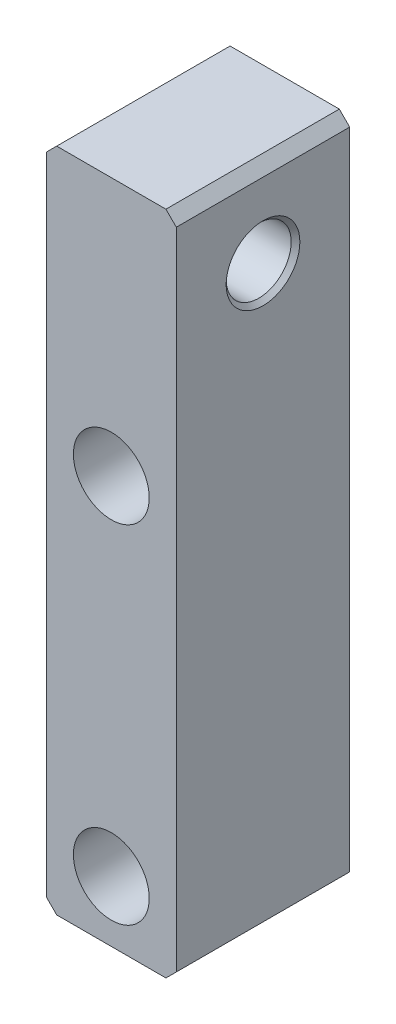
ISO-10303-21;
HEADER;
FILE_DESCRIPTION(('STEP AP214'),'2;1');
FILE_NAME('part.step','',(''),(''),'','','');
FILE_SCHEMA(('AUTOMOTIVE_DESIGN { 1 0 10303 214 1 1 1 1 }'));
ENDSEC;
DATA;
#1=APPLICATION_CONTEXT('core data for automotive mechanical design processes');
#2=APPLICATION_PROTOCOL_DEFINITION('international standard','automotive_design',2000,#1);
#3=PRODUCT_CONTEXT('',#1,'mechanical');
#4=PRODUCT('Part','Part','',(#3));
#5=PRODUCT_RELATED_PRODUCT_CATEGORY('part','',(#4));
#6=PRODUCT_DEFINITION_FORMATION('','',#4);
#7=PRODUCT_DEFINITION_CONTEXT('part definition',#1,'design');
#8=PRODUCT_DEFINITION('design','',#6,#7);
#9=PRODUCT_DEFINITION_SHAPE('','',#8);
#10=(LENGTH_UNIT() NAMED_UNIT(*) SI_UNIT(.MILLI.,.METRE.));
#11=(NAMED_UNIT(*) PLANE_ANGLE_UNIT() SI_UNIT($,.RADIAN.));
#12=(NAMED_UNIT(*) SI_UNIT($,.STERADIAN.) SOLID_ANGLE_UNIT());
#13=UNCERTAINTY_MEASURE_WITH_UNIT(LENGTH_MEASURE(1.E-05),#10,'distance_accuracy_value','');
#14=(GEOMETRIC_REPRESENTATION_CONTEXT(3) GLOBAL_UNCERTAINTY_ASSIGNED_CONTEXT((#13)) GLOBAL_UNIT_ASSIGNED_CONTEXT((#10,
#11,#12)) REPRESENTATION_CONTEXT('',''));
#15=CARTESIAN_POINT('',(0.,0.,0.));
#16=DIRECTION('',(0.,0.,1.));
#17=DIRECTION('',(1.,0.,0.));
#18=AXIS2_PLACEMENT_3D('',#15,#16,#17);
#19=CARTESIAN_POINT('',(-9.52500000000001,87.122,-12.7));
#20=DIRECTION('',(-0.707106781186549,0.707106781186546,0.));
#21=DIRECTION('',(-0.707106781186546,-0.707106781186549,0.));
#22=AXIS2_PLACEMENT_3D('',#19,#20,#21);
#23=PLANE('',#22);
#24=DIRECTION('',(-0.707106781186546,-0.707106781186549,0.));
#25=VECTOR('',#24,1.);
#26=CARTESIAN_POINT('',(-9.52500000000001,87.122,12.7));
#27=LINE('',#26,#25);
#28=CARTESIAN_POINT('',(-8.00100000000002,88.646,12.7));
#29=VERTEX_POINT('',#28);
#30=CARTESIAN_POINT('',(-9.52500000000001,87.122,12.7));
#31=VERTEX_POINT('',#30);
#32=EDGE_CURVE('E136',#29,#31,#27,.T.);
#33=ORIENTED_EDGE('',*,*,#32,.F.);
#34=DIRECTION('',(0.,0.,1.));
#35=VECTOR('',#34,1.);
#36=CARTESIAN_POINT('',(-8.00100000000002,88.646,-12.7));
#37=LINE('',#36,#35);
#38=CARTESIAN_POINT('',(-8.00100000000002,88.646,-12.7));
#39=VERTEX_POINT('',#38);
#40=EDGE_CURVE('E11',#39,#29,#37,.T.);
#41=ORIENTED_EDGE('',*,*,#40,.F.);
#42=DIRECTION('',(-0.707106781186546,-0.707106781186549,0.));
#43=VECTOR('',#42,1.);
#44=CARTESIAN_POINT('',(-9.52500000000001,87.122,-12.7));
#45=LINE('',#44,#43);
#46=CARTESIAN_POINT('',(-9.52500000000001,87.122,-12.7));
#47=VERTEX_POINT('',#46);
#48=EDGE_CURVE('E157',#39,#47,#45,.T.);
#49=ORIENTED_EDGE('',*,*,#48,.T.);
#50=DIRECTION('',(0.,0.,1.));
#51=VECTOR('',#50,1.);
#52=CARTESIAN_POINT('',(-9.52500000000001,87.122,-12.7));
#53=LINE('',#52,#51);
#54=EDGE_CURVE('E42',#47,#31,#53,.T.);
#55=ORIENTED_EDGE('',*,*,#54,.T.);
#56=EDGE_LOOP('',(#33,#41,#49,#55));
#57=FACE_BOUND('',#56,.T.);
#58=ADVANCED_FACE('F39',(#57),#23,.T.);
#59=CARTESIAN_POINT('',(-8.00100000000002,88.646,-12.7));
#60=DIRECTION('',(0.,1.,0.));
#61=DIRECTION('',(0.,0.,1.));
#62=AXIS2_PLACEMENT_3D('',#59,#60,#61);
#63=PLANE('',#62);
#64=DIRECTION('',(-1.,0.,0.));
#65=VECTOR('',#64,1.);
#66=CARTESIAN_POINT('',(-8.00100000000002,88.646,12.7));
#67=LINE('',#66,#65);
#68=CARTESIAN_POINT('',(8.001,88.646,12.7));
#69=VERTEX_POINT('',#68);
#70=EDGE_CURVE('E155',#69,#29,#67,.T.);
#71=ORIENTED_EDGE('',*,*,#70,.F.);
#72=DIRECTION('',(0.,0.,1.));
#73=VECTOR('',#72,1.);
#74=CARTESIAN_POINT('',(8.001,88.646,-12.7));
#75=LINE('',#74,#73);
#76=CARTESIAN_POINT('',(8.001,88.646,-12.7));
#77=VERTEX_POINT('',#76);
#78=EDGE_CURVE('E48',#77,#69,#75,.T.);
#79=ORIENTED_EDGE('',*,*,#78,.F.);
#80=DIRECTION('',(-1.,0.,0.));
#81=VECTOR('',#80,1.);
#82=CARTESIAN_POINT('',(-8.00100000000002,88.646,-12.7));
#83=LINE('',#82,#81);
#84=EDGE_CURVE('E126',#77,#39,#83,.T.);
#85=ORIENTED_EDGE('',*,*,#84,.T.);
#86=ORIENTED_EDGE('',*,*,#40,.T.);
#87=EDGE_LOOP('',(#71,#79,#85,#86));
#88=FACE_BOUND('',#87,.T.);
#89=ADVANCED_FACE('F169',(#88),#63,.T.);
#90=CARTESIAN_POINT('',(8.001,88.646,-12.7));
#91=DIRECTION('',(0.707106781186545,0.70710678118655,0.));
#92=DIRECTION('',(-0.70710678118655,0.707106781186545,0.));
#93=AXIS2_PLACEMENT_3D('',#90,#91,#92);
#94=PLANE('',#93);
#95=DIRECTION('',(-0.70710678118655,0.707106781186545,0.));
#96=VECTOR('',#95,1.);
#97=CARTESIAN_POINT('',(8.001,88.646,12.7));
#98=LINE('',#97,#96);
#99=CARTESIAN_POINT('',(9.52499999999999,87.122,12.7));
#100=VERTEX_POINT('',#99);
#101=EDGE_CURVE('E113',#100,#69,#98,.T.);
#102=ORIENTED_EDGE('',*,*,#101,.F.);
#103=DIRECTION('',(0.,0.,1.));
#104=VECTOR('',#103,1.);
#105=CARTESIAN_POINT('',(9.52499999999999,87.122,-12.7));
#106=LINE('',#105,#104);
#107=CARTESIAN_POINT('',(9.52499999999999,87.122,-12.7));
#108=VERTEX_POINT('',#107);
#109=EDGE_CURVE('E108',#108,#100,#106,.T.);
#110=ORIENTED_EDGE('',*,*,#109,.F.);
#111=DIRECTION('',(-0.70710678118655,0.707106781186545,0.));
#112=VECTOR('',#111,1.);
#113=CARTESIAN_POINT('',(8.001,88.646,-12.7));
#114=LINE('',#113,#112);
#115=EDGE_CURVE('E111',#108,#77,#114,.T.);
#116=ORIENTED_EDGE('',*,*,#115,.T.);
#117=ORIENTED_EDGE('',*,*,#78,.T.);
#118=EDGE_LOOP('',(#102,#110,#116,#117));
#119=FACE_BOUND('',#118,.T.);
#120=ADVANCED_FACE('F110',(#119),#94,.T.);
#121=CARTESIAN_POINT('',(9.52499999999999,87.122,-12.7));
#122=DIRECTION('',(1.,0.,0.));
#123=DIRECTION('',(0.,1.,0.));
#124=AXIS2_PLACEMENT_3D('',#121,#122,#123);
#125=PLANE('',#124);
#126=CARTESIAN_POINT('',(9.52500000000001,76.2,0.));
#127=DIRECTION('',(1.,0.,0.));
#128=DIRECTION('',(0.,0.,-1.));
#129=AXIS2_PLACEMENT_3D('',#126,#127,#128);
#130=CIRCLE('',#129,5.3975);
#131=CARTESIAN_POINT('',(9.52500000000001,76.2,-5.3975));
#132=VERTEX_POINT('',#131);
#133=EDGE_CURVE('E204',#132,#132,#130,.T.);
#134=ORIENTED_EDGE('',*,*,#133,.F.);
#135=EDGE_LOOP('',(#134));
#136=FACE_BOUND('',#135,.T.);
#137=DIRECTION('',(0.,1.,0.));
#138=VECTOR('',#137,1.);
#139=CARTESIAN_POINT('',(9.52499999999999,87.122,12.7));
#140=LINE('',#139,#138);
#141=CARTESIAN_POINT('',(9.52500000000003,-7.36599999999991,12.7));
#142=VERTEX_POINT('',#141);
#143=EDGE_CURVE('E152',#142,#100,#140,.T.);
#144=ORIENTED_EDGE('',*,*,#143,.F.);
#145=DIRECTION('',(0.,0.,1.));
#146=VECTOR('',#145,1.);
#147=CARTESIAN_POINT('',(9.52500000000003,-7.36599999999991,-12.7));
#148=LINE('',#147,#146);
#149=CARTESIAN_POINT('',(9.52500000000003,-7.36599999999991,-12.7));
#150=VERTEX_POINT('',#149);
#151=EDGE_CURVE('E118',#150,#142,#148,.T.);
#152=ORIENTED_EDGE('',*,*,#151,.F.);
#153=DIRECTION('',(0.,1.,0.));
#154=VECTOR('',#153,1.);
#155=CARTESIAN_POINT('',(9.52499999999999,87.122,-12.7));
#156=LINE('',#155,#154);
#157=EDGE_CURVE('E124',#150,#108,#156,.T.);
#158=ORIENTED_EDGE('',*,*,#157,.T.);
#159=ORIENTED_EDGE('',*,*,#109,.T.);
#160=EDGE_LOOP('',(#144,#152,#158,#159));
#161=FACE_BOUND('',#160,.T.);
#162=ADVANCED_FACE('F128',(#136,#161),#125,.T.);
#163=CARTESIAN_POINT('',(8.00100000000004,-8.88999999999991,-12.7));
#164=DIRECTION('',(0.70710678118655,-0.707106781186545,0.));
#165=DIRECTION('',(0.707106781186545,0.70710678118655,0.));
#166=AXIS2_PLACEMENT_3D('',#163,#164,#165);
#167=PLANE('',#166);
#168=DIRECTION('',(0.707106781186545,0.70710678118655,0.));
#169=VECTOR('',#168,1.);
#170=CARTESIAN_POINT('',(8.00100000000004,-8.88999999999991,12.7));
#171=LINE('',#170,#169);
#172=CARTESIAN_POINT('',(8.00100000000004,-8.88999999999991,12.7));
#173=VERTEX_POINT('',#172);
#174=EDGE_CURVE('E149',#173,#142,#171,.T.);
#175=ORIENTED_EDGE('',*,*,#174,.F.);
#176=DIRECTION('',(0.,0.,1.));
#177=VECTOR('',#176,1.);
#178=CARTESIAN_POINT('',(8.00100000000004,-8.88999999999991,-12.7));
#179=LINE('',#178,#177);
#180=CARTESIAN_POINT('',(8.00100000000004,-8.88999999999991,-12.7));
#181=VERTEX_POINT('',#180);
#182=EDGE_CURVE('E161',#181,#173,#179,.T.);
#183=ORIENTED_EDGE('',*,*,#182,.F.);
#184=DIRECTION('',(0.707106781186545,0.70710678118655,0.));
#185=VECTOR('',#184,1.);
#186=CARTESIAN_POINT('',(8.00100000000004,-8.88999999999991,-12.7));
#187=LINE('',#186,#185);
#188=EDGE_CURVE('E129',#181,#150,#187,.T.);
#189=ORIENTED_EDGE('',*,*,#188,.T.);
#190=ORIENTED_EDGE('',*,*,#151,.T.);
#191=EDGE_LOOP('',(#175,#183,#189,#190));
#192=FACE_BOUND('',#191,.T.);
#193=ADVANCED_FACE('F182',(#192),#167,.T.);
#194=CARTESIAN_POINT('',(-8.00099999999999,-8.88999999999992,-12.7));
#195=DIRECTION('',(0.,-1.,0.));
#196=DIRECTION('',(1.,0.,0.));
#197=AXIS2_PLACEMENT_3D('',#194,#195,#196);
#198=PLANE('',#197);
#199=DIRECTION('',(1.,0.,0.));
#200=VECTOR('',#199,1.);
#201=CARTESIAN_POINT('',(-8.00099999999999,-8.88999999999992,12.7));
#202=LINE('',#201,#200);
#203=CARTESIAN_POINT('',(-8.00099999999999,-8.88999999999992,12.7));
#204=VERTEX_POINT('',#203);
#205=EDGE_CURVE('E146',#204,#173,#202,.T.);
#206=ORIENTED_EDGE('',*,*,#205,.F.);
#207=DIRECTION('',(0.,0.,1.));
#208=VECTOR('',#207,1.);
#209=CARTESIAN_POINT('',(-8.00099999999999,-8.88999999999992,-12.7));
#210=LINE('',#209,#208);
#211=CARTESIAN_POINT('',(-8.00099999999999,-8.88999999999992,-12.7));
#212=VERTEX_POINT('',#211);
#213=EDGE_CURVE('E163',#212,#204,#210,.T.);
#214=ORIENTED_EDGE('',*,*,#213,.F.);
#215=DIRECTION('',(1.,0.,0.));
#216=VECTOR('',#215,1.);
#217=CARTESIAN_POINT('',(-8.00099999999999,-8.88999999999992,-12.7));
#218=LINE('',#217,#216);
#219=EDGE_CURVE('E131',#212,#181,#218,.T.);
#220=ORIENTED_EDGE('',*,*,#219,.T.);
#221=ORIENTED_EDGE('',*,*,#182,.T.);
#222=EDGE_LOOP('',(#206,#214,#220,#221));
#223=FACE_BOUND('',#222,.T.);
#224=ADVANCED_FACE('F186',(#223),#198,.T.);
#225=CARTESIAN_POINT('',(-9.52499999999998,-7.36599999999993,-12.7));
#226=DIRECTION('',(-0.707106781186547,-0.707106781186548,0.));
#227=DIRECTION('',(0.707106781186548,-0.707106781186547,0.));
#228=AXIS2_PLACEMENT_3D('',#225,#226,#227);
#229=PLANE('',#228);
#230=DIRECTION('',(0.707106781186548,-0.707106781186547,0.));
#231=VECTOR('',#230,1.);
#232=CARTESIAN_POINT('',(-9.52499999999998,-7.36599999999993,12.7));
#233=LINE('',#232,#231);
#234=CARTESIAN_POINT('',(-9.52499999999998,-7.36599999999993,12.7));
#235=VERTEX_POINT('',#234);
#236=EDGE_CURVE('E143',#235,#204,#233,.T.);
#237=ORIENTED_EDGE('',*,*,#236,.F.);
#238=DIRECTION('',(0.,0.,1.));
#239=VECTOR('',#238,1.);
#240=CARTESIAN_POINT('',(-9.52499999999998,-7.36599999999993,-12.7));
#241=LINE('',#240,#239);
#242=CARTESIAN_POINT('',(-9.52499999999998,-7.36599999999993,-12.7));
#243=VERTEX_POINT('',#242);
#244=EDGE_CURVE('E164',#243,#235,#241,.T.);
#245=ORIENTED_EDGE('',*,*,#244,.F.);
#246=DIRECTION('',(0.707106781186548,-0.707106781186547,0.));
#247=VECTOR('',#246,1.);
#248=CARTESIAN_POINT('',(-9.52499999999998,-7.36599999999993,-12.7));
#249=LINE('',#248,#247);
#250=EDGE_CURVE('E222',#243,#212,#249,.T.);
#251=ORIENTED_EDGE('',*,*,#250,.T.);
#252=ORIENTED_EDGE('',*,*,#213,.T.);
#253=EDGE_LOOP('',(#237,#245,#251,#252));
#254=FACE_BOUND('',#253,.T.);
#255=ADVANCED_FACE('F190',(#254),#229,.T.);
#256=CARTESIAN_POINT('',(-9.52500000000001,87.122,-12.7));
#257=DIRECTION('',(-1.,0.,0.));
#258=DIRECTION('',(0.,-1.,0.));
#259=AXIS2_PLACEMENT_3D('',#256,#257,#258);
#260=PLANE('',#259);
#261=CARTESIAN_POINT('',(-9.525,76.2,0.));
#262=DIRECTION('',(1.,0.,0.));
#263=DIRECTION('',(0.,0.,-1.));
#264=AXIS2_PLACEMENT_3D('',#261,#262,#263);
#265=CIRCLE('',#264,5.3975);
#266=CARTESIAN_POINT('',(-9.525,76.2,-5.3975));
#267=VERTEX_POINT('',#266);
#268=EDGE_CURVE('E202',#267,#267,#265,.T.);
#269=ORIENTED_EDGE('',*,*,#268,.T.);
#270=EDGE_LOOP('',(#269));
#271=FACE_BOUND('',#270,.T.);
#272=DIRECTION('',(0.,-1.,0.));
#273=VECTOR('',#272,1.);
#274=CARTESIAN_POINT('',(-9.52500000000001,87.122,12.7));
#275=LINE('',#274,#273);
#276=EDGE_CURVE('E139',#31,#235,#275,.T.);
#277=ORIENTED_EDGE('',*,*,#276,.F.);
#278=ORIENTED_EDGE('',*,*,#54,.F.);
#279=DIRECTION('',(0.,-1.,0.));
#280=VECTOR('',#279,1.);
#281=CARTESIAN_POINT('',(-9.52500000000001,87.122,-12.7));
#282=LINE('',#281,#280);
#283=EDGE_CURVE('E220',#47,#243,#282,.T.);
#284=ORIENTED_EDGE('',*,*,#283,.T.);
#285=ORIENTED_EDGE('',*,*,#244,.T.);
#286=EDGE_LOOP('',(#277,#278,#284,#285));
#287=FACE_BOUND('',#286,.T.);
#288=ADVANCED_FACE('F166',(#271,#287),#260,.T.);
#289=CARTESIAN_POINT('',(0.,0.,-12.7));
#290=DIRECTION('',(0.,0.,-1.));
#291=DIRECTION('',(-1.,0.,0.));
#292=AXIS2_PLACEMENT_3D('',#289,#290,#291);
#293=PLANE('',#292);
#294=CARTESIAN_POINT('',(0.,0.,-12.7));
#295=DIRECTION('',(0.,0.,-1.));
#296=DIRECTION('',(-1.,0.,0.));
#297=AXIS2_PLACEMENT_3D('',#294,#295,#296);
#298=CIRCLE('',#297,3.3782);
#299=CARTESIAN_POINT('',(-3.3782,0.,-12.7));
#300=VERTEX_POINT('',#299);
#301=EDGE_CURVE('E269',#300,#300,#298,.T.);
#302=ORIENTED_EDGE('',*,*,#301,.F.);
#303=EDGE_LOOP('',(#302));
#304=FACE_BOUND('',#303,.T.);
#305=CARTESIAN_POINT('',(0.,50.8,-12.7));
#306=DIRECTION('',(0.,0.,-1.));
#307=DIRECTION('',(-1.,0.,0.));
#308=AXIS2_PLACEMENT_3D('',#305,#306,#307);
#309=CIRCLE('',#308,3.3782);
#310=CARTESIAN_POINT('',(-3.3782,50.8,-12.7));
#311=VERTEX_POINT('',#310);
#312=EDGE_CURVE('E205',#311,#311,#309,.T.);
#313=ORIENTED_EDGE('',*,*,#312,.F.);
#314=EDGE_LOOP('',(#313));
#315=FACE_BOUND('',#314,.T.);
#316=ORIENTED_EDGE('',*,*,#48,.F.);
#317=ORIENTED_EDGE('',*,*,#84,.F.);
#318=ORIENTED_EDGE('',*,*,#115,.F.);
#319=ORIENTED_EDGE('',*,*,#157,.F.);
#320=ORIENTED_EDGE('',*,*,#188,.F.);
#321=ORIENTED_EDGE('',*,*,#219,.F.);
#322=ORIENTED_EDGE('',*,*,#250,.F.);
#323=ORIENTED_EDGE('',*,*,#283,.F.);
#324=EDGE_LOOP('',(#316,#317,#318,#319,#320,#321,#322,#323));
#325=FACE_BOUND('',#324,.T.);
#326=ADVANCED_FACE('F122',(#304,#315,#325),#293,.T.);
#327=CARTESIAN_POINT('',(0.,0.,12.7));
#328=DIRECTION('',(0.,0.,-1.));
#329=DIRECTION('',(-1.,0.,0.));
#330=AXIS2_PLACEMENT_3D('',#327,#328,#329);
#331=PLANE('',#330);
#332=CARTESIAN_POINT('',(0.,0.,12.7));
#333=DIRECTION('',(0.,0.,1.));
#334=DIRECTION('',(1.,0.,0.));
#335=AXIS2_PLACEMENT_3D('',#332,#333,#334);
#336=CIRCLE('',#335,5.55625);
#337=CARTESIAN_POINT('',(5.55625,0.,12.7));
#338=VERTEX_POINT('',#337);
#339=EDGE_CURVE('E263',#338,#338,#336,.T.);
#340=ORIENTED_EDGE('',*,*,#339,.F.);
#341=EDGE_LOOP('',(#340));
#342=FACE_BOUND('',#341,.T.);
#343=CARTESIAN_POINT('',(0.,50.8,12.7));
#344=DIRECTION('',(0.,0.,1.));
#345=DIRECTION('',(1.,0.,0.));
#346=AXIS2_PLACEMENT_3D('',#343,#344,#345);
#347=CIRCLE('',#346,5.55625);
#348=CARTESIAN_POINT('',(5.55625,50.8,12.7));
#349=VERTEX_POINT('',#348);
#350=EDGE_CURVE('E266',#349,#349,#347,.T.);
#351=ORIENTED_EDGE('',*,*,#350,.F.);
#352=EDGE_LOOP('',(#351));
#353=FACE_BOUND('',#352,.T.);
#354=ORIENTED_EDGE('',*,*,#32,.T.);
#355=ORIENTED_EDGE('',*,*,#276,.T.);
#356=ORIENTED_EDGE('',*,*,#236,.T.);
#357=ORIENTED_EDGE('',*,*,#205,.T.);
#358=ORIENTED_EDGE('',*,*,#174,.T.);
#359=ORIENTED_EDGE('',*,*,#143,.T.);
#360=ORIENTED_EDGE('',*,*,#101,.T.);
#361=ORIENTED_EDGE('',*,*,#70,.T.);
#362=EDGE_LOOP('',(#354,#355,#356,#357,#358,#359,#360,#361));
#363=FACE_BOUND('',#362,.T.);
#364=ADVANCED_FACE('F168',(#342,#353,#363),#331,.F.);
#365=CARTESIAN_POINT('',(-8.89,76.2,0.));
#366=DIRECTION('',(-1.,0.,0.));
#367=DIRECTION('',(0.,0.,1.));
#368=AXIS2_PLACEMENT_3D('',#365,#366,#367);
#369=CONICAL_SURFACE('',#368,4.76249999999999,0.785398163397454);
#370=ORIENTED_EDGE('',*,*,#268,.F.);
#371=EDGE_LOOP('',(#370));
#372=FACE_BOUND('',#371,.T.);
#373=CARTESIAN_POINT('',(-8.89,76.2,0.));
#374=DIRECTION('',(1.,0.,0.));
#375=DIRECTION('',(0.,0.,-1.));
#376=AXIS2_PLACEMENT_3D('',#373,#374,#375);
#377=CIRCLE('',#376,4.76249999999999);
#378=CARTESIAN_POINT('',(-8.89,76.2,-4.76249999999999));
#379=VERTEX_POINT('',#378);
#380=EDGE_CURVE('E140',#379,#379,#377,.T.);
#381=ORIENTED_EDGE('',*,*,#380,.T.);
#382=EDGE_LOOP('',(#381));
#383=FACE_BOUND('',#382,.T.);
#384=ADVANCED_FACE('F231',(#372,#383),#369,.F.);
#385=CARTESIAN_POINT('',(9.52500000000001,76.2,0.));
#386=DIRECTION('',(1.,0.,0.));
#387=DIRECTION('',(0.,0.,-1.));
#388=AXIS2_PLACEMENT_3D('',#385,#386,#387);
#389=CYLINDRICAL_SURFACE('',#388,4.7625);
#390=ORIENTED_EDGE('',*,*,#380,.F.);
#391=EDGE_LOOP('',(#390));
#392=FACE_BOUND('',#391,.T.);
#393=CARTESIAN_POINT('',(8.89000000000002,76.2,0.));
#394=DIRECTION('',(1.,0.,0.));
#395=DIRECTION('',(0.,0.,-1.));
#396=AXIS2_PLACEMENT_3D('',#393,#394,#395);
#397=CIRCLE('',#396,4.7625);
#398=CARTESIAN_POINT('',(8.89000000000002,76.2,-4.7625));
#399=VERTEX_POINT('',#398);
#400=EDGE_CURVE('E208',#399,#399,#397,.T.);
#401=ORIENTED_EDGE('',*,*,#400,.T.);
#402=EDGE_LOOP('',(#401));
#403=FACE_BOUND('',#402,.T.);
#404=ADVANCED_FACE('F233',(#392,#403),#389,.F.);
#405=CARTESIAN_POINT('',(9.52500000000001,76.2,0.));
#406=DIRECTION('',(1.,0.,0.));
#407=DIRECTION('',(0.,0.,-1.));
#408=AXIS2_PLACEMENT_3D('',#405,#406,#407);
#409=CONICAL_SURFACE('',#408,5.3975,0.785398163397448);
#410=ORIENTED_EDGE('',*,*,#400,.F.);
#411=EDGE_LOOP('',(#410));
#412=FACE_BOUND('',#411,.T.);
#413=ORIENTED_EDGE('',*,*,#133,.T.);
#414=EDGE_LOOP('',(#413));
#415=FACE_BOUND('',#414,.T.);
#416=ADVANCED_FACE('F236',(#412,#415),#409,.F.);
#417=CARTESIAN_POINT('',(0.,50.8,12.7));
#418=DIRECTION('',(0.,0.,1.));
#419=DIRECTION('',(1.,0.,0.));
#420=AXIS2_PLACEMENT_3D('',#417,#418,#419);
#421=CYLINDRICAL_SURFACE('',#420,3.3782);
#422=CARTESIAN_POINT('',(0.,50.8,3.048));
#423=DIRECTION('',(0.,0.,1.));
#424=DIRECTION('',(1.,0.,0.));
#425=AXIS2_PLACEMENT_3D('',#422,#423,#424);
#426=CIRCLE('',#425,3.3782);
#427=CARTESIAN_POINT('',(3.3782,50.8,3.048));
#428=VERTEX_POINT('',#427);
#429=EDGE_CURVE('E211',#428,#428,#426,.T.);
#430=ORIENTED_EDGE('',*,*,#429,.T.);
#431=EDGE_LOOP('',(#430));
#432=FACE_BOUND('',#431,.T.);
#433=ORIENTED_EDGE('',*,*,#312,.T.);
#434=EDGE_LOOP('',(#433));
#435=FACE_BOUND('',#434,.T.);
#436=ADVANCED_FACE('F242',(#432,#435),#421,.F.);
#437=CARTESIAN_POINT('',(3.3782,50.8,3.048));
#438=DIRECTION('',(0.,0.,-1.));
#439=DIRECTION('',(-1.,0.,0.));
#440=AXIS2_PLACEMENT_3D('',#437,#438,#439);
#441=PLANE('',#440);
#442=ORIENTED_EDGE('',*,*,#429,.F.);
#443=EDGE_LOOP('',(#442));
#444=FACE_BOUND('',#443,.T.);
#445=CARTESIAN_POINT('',(0.,50.8,3.048));
#446=DIRECTION('',(0.,0.,1.));
#447=DIRECTION('',(1.,0.,0.));
#448=AXIS2_PLACEMENT_3D('',#445,#446,#447);
#449=CIRCLE('',#448,5.55625);
#450=CARTESIAN_POINT('',(5.55625,50.8,3.048));
#451=VERTEX_POINT('',#450);
#452=EDGE_CURVE('E268',#451,#451,#449,.T.);
#453=ORIENTED_EDGE('',*,*,#452,.T.);
#454=EDGE_LOOP('',(#453));
#455=FACE_BOUND('',#454,.T.);
#456=ADVANCED_FACE('F248',(#444,#455),#441,.F.);
#457=CARTESIAN_POINT('',(0.,50.8,12.7));
#458=DIRECTION('',(0.,0.,1.));
#459=DIRECTION('',(1.,0.,0.));
#460=AXIS2_PLACEMENT_3D('',#457,#458,#459);
#461=CYLINDRICAL_SURFACE('',#460,5.55625);
#462=ORIENTED_EDGE('',*,*,#452,.F.);
#463=EDGE_LOOP('',(#462));
#464=FACE_BOUND('',#463,.T.);
#465=ORIENTED_EDGE('',*,*,#350,.T.);
#466=EDGE_LOOP('',(#465));
#467=FACE_BOUND('',#466,.T.);
#468=ADVANCED_FACE('F283',(#464,#467),#461,.F.);
#469=CARTESIAN_POINT('',(0.,0.,12.7));
#470=DIRECTION('',(0.,0.,1.));
#471=DIRECTION('',(1.,0.,0.));
#472=AXIS2_PLACEMENT_3D('',#469,#470,#471);
#473=CYLINDRICAL_SURFACE('',#472,3.3782);
#474=CARTESIAN_POINT('',(0.,0.,3.048));
#475=DIRECTION('',(0.,0.,1.));
#476=DIRECTION('',(1.,0.,0.));
#477=AXIS2_PLACEMENT_3D('',#474,#475,#476);
#478=CIRCLE('',#477,3.3782);
#479=CARTESIAN_POINT('',(3.3782,0.,3.048));
#480=VERTEX_POINT('',#479);
#481=EDGE_CURVE('E274',#480,#480,#478,.T.);
#482=ORIENTED_EDGE('',*,*,#481,.T.);
#483=EDGE_LOOP('',(#482));
#484=FACE_BOUND('',#483,.T.);
#485=ORIENTED_EDGE('',*,*,#301,.T.);
#486=EDGE_LOOP('',(#485));
#487=FACE_BOUND('',#486,.T.);
#488=ADVANCED_FACE('F287',(#484,#487),#473,.F.);
#489=CARTESIAN_POINT('',(3.3782,0.,3.048));
#490=DIRECTION('',(0.,0.,-1.));
#491=DIRECTION('',(-1.,0.,0.));
#492=AXIS2_PLACEMENT_3D('',#489,#490,#491);
#493=PLANE('',#492);
#494=ORIENTED_EDGE('',*,*,#481,.F.);
#495=EDGE_LOOP('',(#494));
#496=FACE_BOUND('',#495,.T.);
#497=CARTESIAN_POINT('',(0.,0.,3.048));
#498=DIRECTION('',(0.,0.,1.));
#499=DIRECTION('',(1.,0.,0.));
#500=AXIS2_PLACEMENT_3D('',#497,#498,#499);
#501=CIRCLE('',#500,5.55625);
#502=CARTESIAN_POINT('',(5.55625,0.,3.048));
#503=VERTEX_POINT('',#502);
#504=EDGE_CURVE('E307',#503,#503,#501,.T.);
#505=ORIENTED_EDGE('',*,*,#504,.T.);
#506=EDGE_LOOP('',(#505));
#507=FACE_BOUND('',#506,.T.);
#508=ADVANCED_FACE('F292',(#496,#507),#493,.F.);
#509=CARTESIAN_POINT('',(0.,0.,12.7));
#510=DIRECTION('',(0.,0.,1.));
#511=DIRECTION('',(1.,0.,0.));
#512=AXIS2_PLACEMENT_3D('',#509,#510,#511);
#513=CYLINDRICAL_SURFACE('',#512,5.55625);
#514=ORIENTED_EDGE('',*,*,#504,.F.);
#515=EDGE_LOOP('',(#514));
#516=FACE_BOUND('',#515,.T.);
#517=ORIENTED_EDGE('',*,*,#339,.T.);
#518=EDGE_LOOP('',(#517));
#519=FACE_BOUND('',#518,.T.);
#520=ADVANCED_FACE('F298',(#516,#519),#513,.F.);
#521=CLOSED_SHELL('',(#58,#89,#120,#162,#193,#224,#255,#288,#326,#364,#384,#404,#416,#436,#456,
#468,#488,#508,#520));
#522=MANIFOLD_SOLID_BREP('B2',#521);
#523=ADVANCED_BREP_SHAPE_REPRESENTATION('',(#18,#522),#14);
#524=SHAPE_DEFINITION_REPRESENTATION(#9,#523);
ENDSEC;
END-ISO-10303-21;
